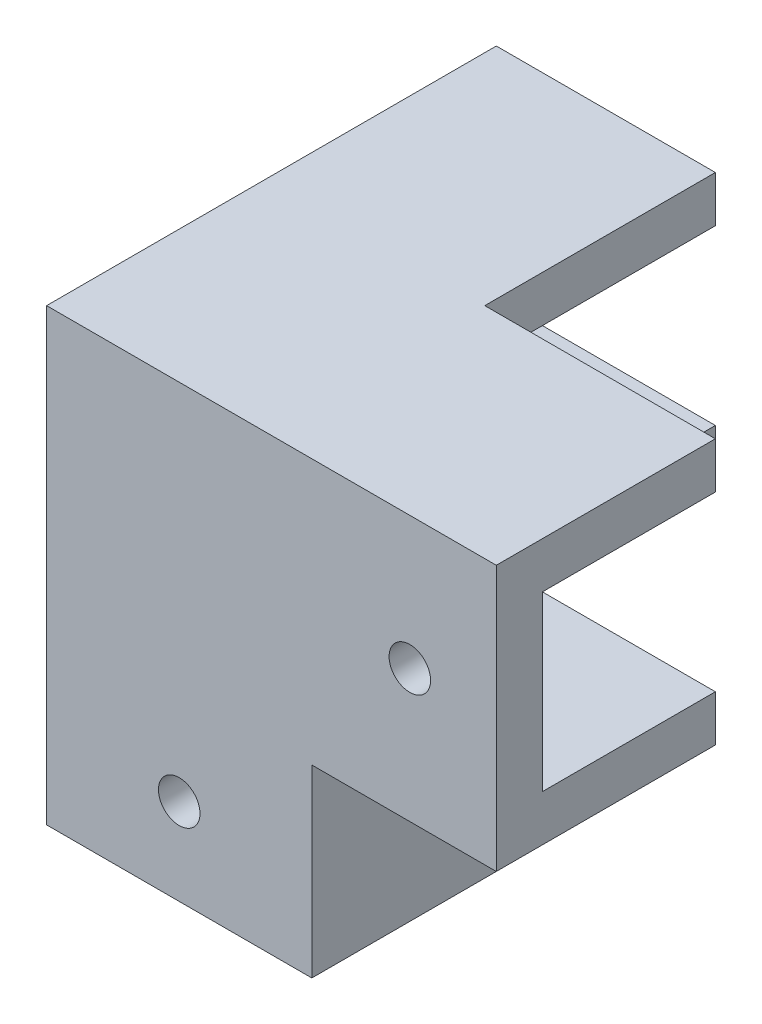
ISO-10303-21;
HEADER;
FILE_DESCRIPTION(('STEP AP214'),'2;1');
FILE_NAME('part.step','',(''),(''),'','','');
FILE_SCHEMA(('AUTOMOTIVE_DESIGN { 1 0 10303 214 1 1 1 1 }'));
ENDSEC;
DATA;
#1=APPLICATION_CONTEXT('core data for automotive mechanical design processes');
#2=APPLICATION_PROTOCOL_DEFINITION('international standard','automotive_design',2000,#1);
#3=PRODUCT_CONTEXT('',#1,'mechanical');
#4=PRODUCT('Part','Part','',(#3));
#5=PRODUCT_RELATED_PRODUCT_CATEGORY('part','',(#4));
#6=PRODUCT_DEFINITION_FORMATION('','',#4);
#7=PRODUCT_DEFINITION_CONTEXT('part definition',#1,'design');
#8=PRODUCT_DEFINITION('design','',#6,#7);
#9=PRODUCT_DEFINITION_SHAPE('','',#8);
#10=(LENGTH_UNIT() NAMED_UNIT(*) SI_UNIT(.MILLI.,.METRE.));
#11=(NAMED_UNIT(*) PLANE_ANGLE_UNIT() SI_UNIT($,.RADIAN.));
#12=(NAMED_UNIT(*) SI_UNIT($,.STERADIAN.) SOLID_ANGLE_UNIT());
#13=UNCERTAINTY_MEASURE_WITH_UNIT(LENGTH_MEASURE(1.E-05),#10,'distance_accuracy_value','');
#14=(GEOMETRIC_REPRESENTATION_CONTEXT(3) GLOBAL_UNCERTAINTY_ASSIGNED_CONTEXT((#13)) GLOBAL_UNIT_ASSIGNED_CONTEXT((#10,
#11,#12)) REPRESENTATION_CONTEXT('',''));
#15=CARTESIAN_POINT('',(0.,0.,0.));
#16=DIRECTION('',(0.,0.,1.));
#17=DIRECTION('',(1.,0.,0.));
#18=AXIS2_PLACEMENT_3D('',#15,#16,#17);
#19=CARTESIAN_POINT('',(0.,20.,-19.9096648090439));
#20=DIRECTION('',(0.,0.,-1.));
#21=DIRECTION('',(-1.,0.,0.));
#22=AXIS2_PLACEMENT_3D('',#19,#20,#21);
#23=PLANE('',#22);
#24=DIRECTION('',(0.,-1.,0.));
#25=VECTOR('',#24,1.);
#26=CARTESIAN_POINT('',(-10.0266666666667,20.,-19.9096648090439));
#27=LINE('',#26,#25);
#28=CARTESIAN_POINT('',(-10.0266666666667,16.,-19.9096648090439));
#29=VERTEX_POINT('',#28);
#30=CARTESIAN_POINT('',(-10.0266666666667,0.,-19.9096648090439));
#31=VERTEX_POINT('',#30);
#32=EDGE_CURVE('E64',#29,#31,#27,.T.);
#33=ORIENTED_EDGE('',*,*,#32,.F.);
#34=DIRECTION('',(-1.,0.,0.));
#35=VECTOR('',#34,1.);
#36=CARTESIAN_POINT('',(-10.0266666666667,16.,-19.9096648090439));
#37=LINE('',#36,#35);
#38=CARTESIAN_POINT('',(8.97333333333333,16.,-19.9096648090439));
#39=VERTEX_POINT('',#38);
#40=EDGE_CURVE('E59',#39,#29,#37,.T.);
#41=ORIENTED_EDGE('',*,*,#40,.F.);
#42=DIRECTION('',(0.,-1.,0.));
#43=VECTOR('',#42,1.);
#44=CARTESIAN_POINT('',(8.97333333333333,20.,-19.9096648090439));
#45=LINE('',#44,#43);
#46=CARTESIAN_POINT('',(8.97333333333333,0.,-19.9096648090439));
#47=VERTEX_POINT('',#46);
#48=EDGE_CURVE('E51',#39,#47,#45,.T.);
#49=ORIENTED_EDGE('',*,*,#48,.T.);
#50=DIRECTION('',(1.,0.,0.));
#51=VECTOR('',#50,1.);
#52=CARTESIAN_POINT('',(0.,0.,-19.9096648090439));
#53=LINE('',#52,#51);
#54=EDGE_CURVE('E363',#31,#47,#53,.T.);
#55=ORIENTED_EDGE('',*,*,#54,.F.);
#56=EDGE_LOOP('',(#33,#41,#49,#55));
#57=FACE_BOUND('',#56,.T.);
#58=ADVANCED_FACE('F41',(#57),#23,.T.);
#59=CARTESIAN_POINT('',(28.9733333333333,0.,-15.9096648090439));
#60=DIRECTION('',(0.,0.,-1.));
#61=DIRECTION('',(-1.,0.,0.));
#62=AXIS2_PLACEMENT_3D('',#59,#60,#61);
#63=PLANE('',#62);
#64=DIRECTION('',(-1.,0.,0.));
#65=VECTOR('',#64,1.);
#66=CARTESIAN_POINT('',(28.9733333333333,35.,-15.9096648090439));
#67=LINE('',#66,#65);
#68=CARTESIAN_POINT('',(28.9733333333333,35.,-15.9096648090439));
#69=VERTEX_POINT('',#68);
#70=CARTESIAN_POINT('',(8.97333333333332,35.,-15.9096648090439));
#71=VERTEX_POINT('',#70);
#72=EDGE_CURVE('E351',#69,#71,#67,.T.);
#73=ORIENTED_EDGE('',*,*,#72,.T.);
#74=DIRECTION('',(0.,1.,0.));
#75=VECTOR('',#74,1.);
#76=CARTESIAN_POINT('',(8.97333333333333,0.,-15.9096648090439));
#77=LINE('',#76,#75);
#78=CARTESIAN_POINT('',(8.97333333333332,39.,-15.9096648090439));
#79=VERTEX_POINT('',#78);
#80=EDGE_CURVE('E11',#71,#79,#77,.T.);
#81=ORIENTED_EDGE('',*,*,#80,.T.);
#82=DIRECTION('',(-1.,0.,0.));
#83=VECTOR('',#82,1.);
#84=CARTESIAN_POINT('',(28.9733333333333,39.,-15.9096648090439));
#85=LINE('',#84,#83);
#86=CARTESIAN_POINT('',(28.9733333333333,39.,-15.9096648090439));
#87=VERTEX_POINT('',#86);
#88=EDGE_CURVE('E336',#87,#79,#85,.T.);
#89=ORIENTED_EDGE('',*,*,#88,.F.);
#90=DIRECTION('',(0.,-1.,0.));
#91=VECTOR('',#90,1.);
#92=CARTESIAN_POINT('',(28.9733333333333,0.,-15.9096648090439));
#93=LINE('',#92,#91);
#94=EDGE_CURVE('E322',#87,#69,#93,.T.);
#95=ORIENTED_EDGE('',*,*,#94,.T.);
#96=EDGE_LOOP('',(#73,#81,#89,#95));
#97=FACE_BOUND('',#96,.T.);
#98=ADVANCED_FACE('F468',(#97),#63,.T.);
#99=CARTESIAN_POINT('',(12.9733333333333,0.,0.));
#100=DIRECTION('',(1.,0.,0.));
#101=DIRECTION('',(0.,0.,-1.));
#102=AXIS2_PLACEMENT_3D('',#99,#100,#101);
#103=PLANE('',#102);
#104=DIRECTION('',(0.,1.,0.));
#105=VECTOR('',#104,1.);
#106=CARTESIAN_POINT('',(12.9733333333333,20.,-15.8096648090439));
#107=LINE('',#106,#105);
#108=CARTESIAN_POINT('',(12.9733333333333,0.,-15.8096648090439));
#109=VERTEX_POINT('',#108);
#110=CARTESIAN_POINT('',(12.9733333333333,16.,-15.8096648090439));
#111=VERTEX_POINT('',#110);
#112=EDGE_CURVE('E297',#109,#111,#107,.T.);
#113=ORIENTED_EDGE('',*,*,#112,.T.);
#114=DIRECTION('',(0.,0.,-1.));
#115=VECTOR('',#114,1.);
#116=CARTESIAN_POINT('',(12.9733333333333,16.,3.09033519095607));
#117=LINE('',#116,#115);
#118=CARTESIAN_POINT('',(12.9733333333333,16.,3.09033519095607));
#119=VERTEX_POINT('',#118);
#120=EDGE_CURVE('E267',#119,#111,#117,.T.);
#121=ORIENTED_EDGE('',*,*,#120,.F.);
#122=DIRECTION('',(0.,-1.,0.));
#123=VECTOR('',#122,1.);
#124=CARTESIAN_POINT('',(12.9733333333333,20.,3.09033519095607));
#125=LINE('',#124,#123);
#126=CARTESIAN_POINT('',(12.9733333333333,0.,3.09033519095607));
#127=VERTEX_POINT('',#126);
#128=EDGE_CURVE('E289',#119,#127,#125,.T.);
#129=ORIENTED_EDGE('',*,*,#128,.T.);
#130=DIRECTION('',(0.,0.,-1.));
#131=VECTOR('',#130,1.);
#132=CARTESIAN_POINT('',(12.9733333333333,0.,3.09033519095607));
#133=LINE('',#132,#131);
#134=EDGE_CURVE('E292',#127,#109,#133,.T.);
#135=ORIENTED_EDGE('',*,*,#134,.T.);
#136=EDGE_LOOP('',(#113,#121,#129,#135));
#137=FACE_BOUND('',#136,.T.);
#138=ADVANCED_FACE('F472',(#137),#103,.T.);
#139=CARTESIAN_POINT('',(8.97333333333333,20.,0.));
#140=DIRECTION('',(1.,0.,0.));
#141=DIRECTION('',(0.,0.,-1.));
#142=AXIS2_PLACEMENT_3D('',#139,#140,#141);
#143=PLANE('',#142);
#144=DIRECTION('',(0.,0.,1.));
#145=VECTOR('',#144,1.);
#146=CARTESIAN_POINT('',(8.97333333333333,0.,0.));
#147=LINE('',#146,#145);
#148=CARTESIAN_POINT('',(8.97333333333333,0.,-15.9096648090439));
#149=VERTEX_POINT('',#148);
#150=EDGE_CURVE('E343',#47,#149,#147,.T.);
#151=ORIENTED_EDGE('',*,*,#150,.F.);
#152=ORIENTED_EDGE('',*,*,#48,.F.);
#153=DIRECTION('',(0.,0.,1.));
#154=VECTOR('',#153,1.);
#155=CARTESIAN_POINT('',(8.97333333333333,16.,-35.9096648090439));
#156=LINE('',#155,#154);
#157=CARTESIAN_POINT('',(8.97333333333333,16.,-35.9096648090439));
#158=VERTEX_POINT('',#157);
#159=EDGE_CURVE('E207',#158,#39,#156,.T.);
#160=ORIENTED_EDGE('',*,*,#159,.F.);
#161=DIRECTION('',(0.,-1.,0.));
#162=VECTOR('',#161,1.);
#163=CARTESIAN_POINT('',(8.97333333333333,20.,-35.9096648090439));
#164=LINE('',#163,#162);
#165=CARTESIAN_POINT('',(8.97333333333333,20.,-35.9096648090439));
#166=VERTEX_POINT('',#165);
#167=EDGE_CURVE('E198',#166,#158,#164,.T.);
#168=ORIENTED_EDGE('',*,*,#167,.F.);
#169=DIRECTION('',(0.,0.,1.));
#170=VECTOR('',#169,1.);
#171=CARTESIAN_POINT('',(8.97333333333333,20.,0.));
#172=LINE('',#171,#170);
#173=CARTESIAN_POINT('',(8.97333333333333,20.,-15.9096648090439));
#174=VERTEX_POINT('',#173);
#175=EDGE_CURVE('E181',#166,#174,#172,.T.);
#176=ORIENTED_EDGE('',*,*,#175,.T.);
#177=DIRECTION('',(0.,-1.,0.));
#178=VECTOR('',#177,1.);
#179=CARTESIAN_POINT('',(8.97333333333333,20.,-15.9096648090439));
#180=LINE('',#179,#178);
#181=EDGE_CURVE('E359',#174,#149,#180,.T.);
#182=ORIENTED_EDGE('',*,*,#181,.T.);
#183=EDGE_LOOP('',(#151,#152,#160,#168,#176,#182));
#184=FACE_BOUND('',#183,.T.);
#185=ADVANCED_FACE('F43',(#184),#143,.T.);
#186=CARTESIAN_POINT('',(-10.0266666666667,20.,0.));
#187=DIRECTION('',(-1.,0.,0.));
#188=DIRECTION('',(0.,0.,1.));
#189=AXIS2_PLACEMENT_3D('',#186,#187,#188);
#190=PLANE('',#189);
#191=CARTESIAN_POINT('',(-10.0266666666667,27.5,-28.4096648090439));
#192=DIRECTION('',(-1.,0.,0.));
#193=DIRECTION('',(0.,0.,1.));
#194=AXIS2_PLACEMENT_3D('',#191,#192,#193);
#195=CIRCLE('',#194,1.8);
#196=CARTESIAN_POINT('',(-10.0266666666667,27.5,-26.6096648090439));
#197=VERTEX_POINT('',#196);
#198=EDGE_CURVE('E413',#197,#197,#195,.T.);
#199=ORIENTED_EDGE('',*,*,#198,.F.);
#200=EDGE_LOOP('',(#199));
#201=FACE_BOUND('',#200,.T.);
#202=CARTESIAN_POINT('',(-10.0266666666667,7.5,-8.40966480904393));
#203=DIRECTION('',(-1.,0.,0.));
#204=DIRECTION('',(0.,0.,1.));
#205=AXIS2_PLACEMENT_3D('',#202,#203,#204);
#206=CIRCLE('',#205,1.8);
#207=CARTESIAN_POINT('',(-10.0266666666667,7.5,-6.60966480904393));
#208=VERTEX_POINT('',#207);
#209=EDGE_CURVE('E423',#208,#208,#206,.T.);
#210=ORIENTED_EDGE('',*,*,#209,.F.);
#211=EDGE_LOOP('',(#210));
#212=FACE_BOUND('',#211,.T.);
#213=DIRECTION('',(0.,0.,1.));
#214=VECTOR('',#213,1.);
#215=CARTESIAN_POINT('',(-10.0266666666667,16.,-35.9096648090439));
#216=LINE('',#215,#214);
#217=CARTESIAN_POINT('',(-10.0266666666667,16.,-35.9096648090439));
#218=VERTEX_POINT('',#217);
#219=EDGE_CURVE('E213',#218,#29,#216,.T.);
#220=ORIENTED_EDGE('',*,*,#219,.T.);
#221=ORIENTED_EDGE('',*,*,#32,.T.);
#222=DIRECTION('',(0.,0.,-1.));
#223=VECTOR('',#222,1.);
#224=CARTESIAN_POINT('',(-10.0266666666667,0.,0.));
#225=LINE('',#224,#223);
#226=CARTESIAN_POINT('',(-10.0266666666667,0.,3.09033519095607));
#227=VERTEX_POINT('',#226);
#228=EDGE_CURVE('E367',#227,#31,#225,.T.);
#229=ORIENTED_EDGE('',*,*,#228,.F.);
#230=DIRECTION('',(0.,-1.,0.));
#231=VECTOR('',#230,1.);
#232=CARTESIAN_POINT('',(-10.0266666666667,20.,3.09033519095607));
#233=LINE('',#232,#231);
#234=CARTESIAN_POINT('',(-10.0266666666667,39.,3.09033519095607));
#235=VERTEX_POINT('',#234);
#236=EDGE_CURVE('E398',#235,#227,#233,.T.);
#237=ORIENTED_EDGE('',*,*,#236,.F.);
#238=DIRECTION('',(0.,0.,-1.));
#239=VECTOR('',#238,1.);
#240=CARTESIAN_POINT('',(-10.0266666666667,39.,0.));
#241=LINE('',#240,#239);
#242=CARTESIAN_POINT('',(-10.0266666666667,39.,-35.9096648090439));
#243=VERTEX_POINT('',#242);
#244=EDGE_CURVE('E317',#235,#243,#241,.T.);
#245=ORIENTED_EDGE('',*,*,#244,.T.);
#246=DIRECTION('',(0.,1.,0.));
#247=VECTOR('',#246,1.);
#248=CARTESIAN_POINT('',(-10.0266666666667,0.,-35.9096648090439));
#249=LINE('',#248,#247);
#250=EDGE_CURVE('E234',#218,#243,#249,.T.);
#251=ORIENTED_EDGE('',*,*,#250,.F.);
#252=EDGE_LOOP('',(#220,#221,#229,#237,#245,#251));
#253=FACE_BOUND('',#252,.T.);
#254=ADVANCED_FACE('F476',(#201,#212,#253),#190,.T.);
#255=CARTESIAN_POINT('',(0.,20.,3.09033519095607));
#256=DIRECTION('',(0.,0.,-1.));
#257=DIRECTION('',(-1.,0.,0.));
#258=AXIS2_PLACEMENT_3D('',#255,#256,#257);
#259=PLANE('',#258);
#260=CARTESIAN_POINT('',(1.47333333333333,7.5,3.09033519095607));
#261=DIRECTION('',(0.,0.,1.));
#262=DIRECTION('',(1.,0.,0.));
#263=AXIS2_PLACEMENT_3D('',#260,#261,#262);
#264=CIRCLE('',#263,1.8);
#265=CARTESIAN_POINT('',(3.27333333333333,7.5,3.09033519095607));
#266=VERTEX_POINT('',#265);
#267=EDGE_CURVE('E430',#266,#266,#264,.T.);
#268=ORIENTED_EDGE('',*,*,#267,.F.);
#269=EDGE_LOOP('',(#268));
#270=FACE_BOUND('',#269,.T.);
#271=CARTESIAN_POINT('',(21.4733333333333,27.5,3.09033519095607));
#272=DIRECTION('',(0.,0.,1.));
#273=DIRECTION('',(1.,0.,0.));
#274=AXIS2_PLACEMENT_3D('',#271,#272,#273);
#275=CIRCLE('',#274,1.8);
#276=CARTESIAN_POINT('',(23.2733333333333,27.5,3.09033519095607));
#277=VERTEX_POINT('',#276);
#278=EDGE_CURVE('E408',#277,#277,#275,.T.);
#279=ORIENTED_EDGE('',*,*,#278,.F.);
#280=EDGE_LOOP('',(#279));
#281=FACE_BOUND('',#280,.T.);
#282=DIRECTION('',(1.,0.,0.));
#283=VECTOR('',#282,1.);
#284=CARTESIAN_POINT('',(0.,0.,3.09033519095607));
#285=LINE('',#284,#283);
#286=EDGE_CURVE('E371',#227,#127,#285,.T.);
#287=ORIENTED_EDGE('',*,*,#286,.T.);
#288=ORIENTED_EDGE('',*,*,#128,.F.);
#289=DIRECTION('',(-1.,0.,0.));
#290=VECTOR('',#289,1.);
#291=CARTESIAN_POINT('',(28.9733333333333,16.,3.09033519095607));
#292=LINE('',#291,#290);
#293=CARTESIAN_POINT('',(28.9733333333333,16.,3.09033519095607));
#294=VERTEX_POINT('',#293);
#295=EDGE_CURVE('E284',#294,#119,#292,.T.);
#296=ORIENTED_EDGE('',*,*,#295,.F.);
#297=DIRECTION('',(0.,1.,0.));
#298=VECTOR('',#297,1.);
#299=CARTESIAN_POINT('',(28.9733333333333,0.,3.09033519095607));
#300=LINE('',#299,#298);
#301=CARTESIAN_POINT('',(28.9733333333333,39.,3.09033519095607));
#302=VERTEX_POINT('',#301);
#303=EDGE_CURVE('E332',#294,#302,#300,.T.);
#304=ORIENTED_EDGE('',*,*,#303,.T.);
#305=DIRECTION('',(-1.,0.,0.));
#306=VECTOR('',#305,1.);
#307=CARTESIAN_POINT('',(28.9733333333333,39.,3.09033519095607));
#308=LINE('',#307,#306);
#309=EDGE_CURVE('E339',#302,#235,#308,.T.);
#310=ORIENTED_EDGE('',*,*,#309,.T.);
#311=ORIENTED_EDGE('',*,*,#236,.T.);
#312=EDGE_LOOP('',(#287,#288,#296,#304,#310,#311));
#313=FACE_BOUND('',#312,.T.);
#314=ADVANCED_FACE('F445',(#270,#281,#313),#259,.F.);
#315=CARTESIAN_POINT('',(0.,20.,-0.909664809043927));
#316=DIRECTION('',(0.,0.,-1.));
#317=DIRECTION('',(-1.,0.,0.));
#318=AXIS2_PLACEMENT_3D('',#315,#316,#317);
#319=PLANE('',#318);
#320=CARTESIAN_POINT('',(1.47333333333333,7.5,-0.909664809043927));
#321=DIRECTION('',(0.,0.,-1.));
#322=DIRECTION('',(-1.,0.,0.));
#323=AXIS2_PLACEMENT_3D('',#320,#321,#322);
#324=CIRCLE('',#323,1.8);
#325=CARTESIAN_POINT('',(-0.326666666666673,7.5,-0.909664809043927));
#326=VERTEX_POINT('',#325);
#327=EDGE_CURVE('E45',#326,#326,#324,.T.);
#328=ORIENTED_EDGE('',*,*,#327,.F.);
#329=EDGE_LOOP('',(#328));
#330=FACE_BOUND('',#329,.T.);
#331=CARTESIAN_POINT('',(21.4733333333333,27.5,-0.909664809043927));
#332=DIRECTION('',(0.,0.,-1.));
#333=DIRECTION('',(-1.,0.,0.));
#334=AXIS2_PLACEMENT_3D('',#331,#332,#333);
#335=CIRCLE('',#334,1.8);
#336=CARTESIAN_POINT('',(19.6733333333333,27.5,-0.909664809043927));
#337=VERTEX_POINT('',#336);
#338=EDGE_CURVE('E219',#337,#337,#335,.T.);
#339=ORIENTED_EDGE('',*,*,#338,.F.);
#340=EDGE_LOOP('',(#339));
#341=FACE_BOUND('',#340,.T.);
#342=DIRECTION('',(0.,-1.,0.));
#343=VECTOR('',#342,1.);
#344=CARTESIAN_POINT('',(-6.02666666666667,20.,-0.909664809043927));
#345=LINE('',#344,#343);
#346=CARTESIAN_POINT('',(-6.02666666666668,35.,-0.909664809043926));
#347=VERTEX_POINT('',#346);
#348=CARTESIAN_POINT('',(-6.02666666666667,0.,-0.909664809043927));
#349=VERTEX_POINT('',#348);
#350=EDGE_CURVE('E391',#347,#349,#345,.T.);
#351=ORIENTED_EDGE('',*,*,#350,.F.);
#352=DIRECTION('',(-1.,0.,0.));
#353=VECTOR('',#352,1.);
#354=CARTESIAN_POINT('',(28.9733333333333,35.,-0.909664809043926));
#355=LINE('',#354,#353);
#356=CARTESIAN_POINT('',(28.9733333333333,35.,-0.909664809043926));
#357=VERTEX_POINT('',#356);
#358=EDGE_CURVE('E347',#357,#347,#355,.T.);
#359=ORIENTED_EDGE('',*,*,#358,.F.);
#360=DIRECTION('',(0.,1.,0.));
#361=VECTOR('',#360,1.);
#362=CARTESIAN_POINT('',(28.9733333333333,0.,-0.909664809043922));
#363=LINE('',#362,#361);
#364=CARTESIAN_POINT('',(28.9733333333333,20.,-0.909664809043924));
#365=VERTEX_POINT('',#364);
#366=EDGE_CURVE('E329',#365,#357,#363,.T.);
#367=ORIENTED_EDGE('',*,*,#366,.F.);
#368=DIRECTION('',(-1.,0.,0.));
#369=VECTOR('',#368,1.);
#370=CARTESIAN_POINT('',(28.9733333333333,20.,-0.909664809043924));
#371=LINE('',#370,#369);
#372=CARTESIAN_POINT('',(8.97333333333333,20.,-0.909664809043924));
#373=VERTEX_POINT('',#372);
#374=EDGE_CURVE('E344',#365,#373,#371,.T.);
#375=ORIENTED_EDGE('',*,*,#374,.T.);
#376=DIRECTION('',(0.,-1.,0.));
#377=VECTOR('',#376,1.);
#378=CARTESIAN_POINT('',(8.97333333333333,20.,-0.909664809043927));
#379=LINE('',#378,#377);
#380=CARTESIAN_POINT('',(8.97333333333333,0.,-0.909664809043927));
#381=VERTEX_POINT('',#380);
#382=EDGE_CURVE('E394',#373,#381,#379,.T.);
#383=ORIENTED_EDGE('',*,*,#382,.T.);
#384=DIRECTION('',(1.,0.,0.));
#385=VECTOR('',#384,1.);
#386=CARTESIAN_POINT('',(0.,0.,-0.909664809043927));
#387=LINE('',#386,#385);
#388=EDGE_CURVE('E375',#349,#381,#387,.T.);
#389=ORIENTED_EDGE('',*,*,#388,.F.);
#390=EDGE_LOOP('',(#351,#359,#367,#375,#383,#389));
#391=FACE_BOUND('',#390,.T.);
#392=ADVANCED_FACE('F441',(#330,#341,#391),#319,.T.);
#393=CARTESIAN_POINT('',(-6.02666666666667,20.,0.));
#394=DIRECTION('',(-1.,0.,0.));
#395=DIRECTION('',(0.,0.,1.));
#396=AXIS2_PLACEMENT_3D('',#393,#394,#395);
#397=PLANE('',#396);
#398=CARTESIAN_POINT('',(-6.02666666666667,27.5,-28.4096648090439));
#399=DIRECTION('',(-1.,0.,0.));
#400=DIRECTION('',(0.,0.,1.));
#401=AXIS2_PLACEMENT_3D('',#398,#399,#400);
#402=CIRCLE('',#401,1.8);
#403=CARTESIAN_POINT('',(-6.02666666666667,27.5,-26.6096648090439));
#404=VERTEX_POINT('',#403);
#405=EDGE_CURVE('E412',#404,#404,#402,.T.);
#406=ORIENTED_EDGE('',*,*,#405,.T.);
#407=EDGE_LOOP('',(#406));
#408=FACE_BOUND('',#407,.T.);
#409=CARTESIAN_POINT('',(-6.02666666666667,7.5,-8.40966480904393));
#410=DIRECTION('',(-1.,0.,0.));
#411=DIRECTION('',(0.,0.,1.));
#412=AXIS2_PLACEMENT_3D('',#409,#410,#411);
#413=CIRCLE('',#412,1.8);
#414=CARTESIAN_POINT('',(-6.02666666666667,7.5,-6.60966480904393));
#415=VERTEX_POINT('',#414);
#416=EDGE_CURVE('E409',#415,#415,#413,.T.);
#417=ORIENTED_EDGE('',*,*,#416,.T.);
#418=EDGE_LOOP('',(#417));
#419=FACE_BOUND('',#418,.T.);
#420=DIRECTION('',(0.,0.,-1.));
#421=VECTOR('',#420,1.);
#422=CARTESIAN_POINT('',(-6.02666666666667,0.,0.));
#423=LINE('',#422,#421);
#424=CARTESIAN_POINT('',(-6.02666666666667,0.,-15.9096648090439));
#425=VERTEX_POINT('',#424);
#426=EDGE_CURVE('E379',#349,#425,#423,.T.);
#427=ORIENTED_EDGE('',*,*,#426,.T.);
#428=DIRECTION('',(0.,-1.,0.));
#429=VECTOR('',#428,1.);
#430=CARTESIAN_POINT('',(-6.02666666666667,20.,-15.9096648090439));
#431=LINE('',#430,#429);
#432=CARTESIAN_POINT('',(-6.02666666666667,20.,-15.9096648090439));
#433=VERTEX_POINT('',#432);
#434=EDGE_CURVE('E387',#433,#425,#431,.T.);
#435=ORIENTED_EDGE('',*,*,#434,.F.);
#436=DIRECTION('',(0.,0.,-1.));
#437=VECTOR('',#436,1.);
#438=CARTESIAN_POINT('',(-6.02666666666668,20.,-0.909664809043927));
#439=LINE('',#438,#437);
#440=CARTESIAN_POINT('',(-6.02666666666667,20.,-35.9096648090439));
#441=VERTEX_POINT('',#440);
#442=EDGE_CURVE('E247',#433,#441,#439,.T.);
#443=ORIENTED_EDGE('',*,*,#442,.T.);
#444=DIRECTION('',(0.,-1.,0.));
#445=VECTOR('',#444,1.);
#446=CARTESIAN_POINT('',(-6.02666666666668,0.,-35.9096648090439));
#447=LINE('',#446,#445);
#448=CARTESIAN_POINT('',(-6.02666666666667,35.,-35.9096648090439));
#449=VERTEX_POINT('',#448);
#450=EDGE_CURVE('E202',#449,#441,#447,.T.);
#451=ORIENTED_EDGE('',*,*,#450,.F.);
#452=DIRECTION('',(0.,0.,-1.));
#453=VECTOR('',#452,1.);
#454=CARTESIAN_POINT('',(-6.02666666666667,35.,-0.909664809043927));
#455=LINE('',#454,#453);
#456=EDGE_CURVE('E250',#347,#449,#455,.T.);
#457=ORIENTED_EDGE('',*,*,#456,.F.);
#458=ORIENTED_EDGE('',*,*,#350,.T.);
#459=EDGE_LOOP('',(#427,#435,#443,#451,#457,#458));
#460=FACE_BOUND('',#459,.T.);
#461=ADVANCED_FACE('F444',(#408,#419,#460),#397,.F.);
#462=CARTESIAN_POINT('',(0.,20.,-15.9096648090439));
#463=DIRECTION('',(0.,0.,-1.));
#464=DIRECTION('',(-1.,0.,0.));
#465=AXIS2_PLACEMENT_3D('',#462,#463,#464);
#466=PLANE('',#465);
#467=DIRECTION('',(1.,0.,0.));
#468=VECTOR('',#467,1.);
#469=CARTESIAN_POINT('',(0.,0.,-15.9096648090439));
#470=LINE('',#469,#468);
#471=EDGE_CURVE('E191',#425,#149,#470,.T.);
#472=ORIENTED_EDGE('',*,*,#471,.T.);
#473=ORIENTED_EDGE('',*,*,#181,.F.);
#474=DIRECTION('',(1.,0.,0.));
#475=VECTOR('',#474,1.);
#476=CARTESIAN_POINT('',(0.,20.,-15.9096648090439));
#477=LINE('',#476,#475);
#478=EDGE_CURVE('E186',#433,#174,#477,.T.);
#479=ORIENTED_EDGE('',*,*,#478,.F.);
#480=ORIENTED_EDGE('',*,*,#434,.T.);
#481=EDGE_LOOP('',(#472,#473,#479,#480));
#482=FACE_BOUND('',#481,.T.);
#483=ADVANCED_FACE('F462',(#482),#466,.F.);
#484=CARTESIAN_POINT('',(0.,20.,0.));
#485=DIRECTION('',(0.,1.,0.));
#486=DIRECTION('',(0.,0.,1.));
#487=AXIS2_PLACEMENT_3D('',#484,#485,#486);
#488=PLANE('',#487);
#489=ORIENTED_EDGE('',*,*,#442,.F.);
#490=ORIENTED_EDGE('',*,*,#478,.T.);
#491=ORIENTED_EDGE('',*,*,#175,.F.);
#492=DIRECTION('',(1.,0.,0.));
#493=VECTOR('',#492,1.);
#494=CARTESIAN_POINT('',(-10.0266666666667,20.,-35.9096648090439));
#495=LINE('',#494,#493);
#496=EDGE_CURVE('E184',#441,#166,#495,.T.);
#497=ORIENTED_EDGE('',*,*,#496,.F.);
#498=EDGE_LOOP('',(#489,#490,#491,#497));
#499=FACE_BOUND('',#498,.T.);
#500=ADVANCED_FACE('F183',(#499),#488,.T.);
#501=CARTESIAN_POINT('',(0.,0.,0.));
#502=DIRECTION('',(0.,1.,0.));
#503=DIRECTION('',(0.,0.,1.));
#504=AXIS2_PLACEMENT_3D('',#501,#502,#503);
#505=PLANE('',#504);
#506=ORIENTED_EDGE('',*,*,#150,.T.);
#507=ORIENTED_EDGE('',*,*,#471,.F.);
#508=ORIENTED_EDGE('',*,*,#426,.F.);
#509=ORIENTED_EDGE('',*,*,#388,.T.);
#510=DIRECTION('',(0.,0.,-1.));
#511=VECTOR('',#510,1.);
#512=CARTESIAN_POINT('',(8.97333333333333,0.,3.09033519095607));
#513=LINE('',#512,#511);
#514=CARTESIAN_POINT('',(8.97333333333333,0.,-15.8096648090439));
#515=VERTEX_POINT('',#514);
#516=EDGE_CURVE('E288',#381,#515,#513,.T.);
#517=ORIENTED_EDGE('',*,*,#516,.T.);
#518=DIRECTION('',(-1.,0.,0.));
#519=VECTOR('',#518,1.);
#520=CARTESIAN_POINT('',(12.9733333333333,0.,-15.8096648090439));
#521=LINE('',#520,#519);
#522=EDGE_CURVE('E313',#109,#515,#521,.T.);
#523=ORIENTED_EDGE('',*,*,#522,.F.);
#524=ORIENTED_EDGE('',*,*,#134,.F.);
#525=ORIENTED_EDGE('',*,*,#286,.F.);
#526=ORIENTED_EDGE('',*,*,#228,.T.);
#527=ORIENTED_EDGE('',*,*,#54,.T.);
#528=EDGE_LOOP('',(#506,#507,#508,#509,#517,#523,#524,#525,#526,#527));
#529=FACE_BOUND('',#528,.T.);
#530=ADVANCED_FACE('F464',(#529),#505,.F.);
#531=CARTESIAN_POINT('',(28.9733333333333,39.,0.));
#532=DIRECTION('',(0.,1.,0.));
#533=DIRECTION('',(0.,0.,1.));
#534=AXIS2_PLACEMENT_3D('',#531,#532,#533);
#535=PLANE('',#534);
#536=ORIENTED_EDGE('',*,*,#88,.T.);
#537=DIRECTION('',(0.,0.,-1.));
#538=VECTOR('',#537,1.);
#539=CARTESIAN_POINT('',(8.97333333333333,39.,-0.909664809043927));
#540=LINE('',#539,#538);
#541=CARTESIAN_POINT('',(8.97333333333333,39.,-35.9096648090439));
#542=VERTEX_POINT('',#541);
#543=EDGE_CURVE('E243',#79,#542,#540,.T.);
#544=ORIENTED_EDGE('',*,*,#543,.T.);
#545=DIRECTION('',(1.,0.,0.));
#546=VECTOR('',#545,1.);
#547=CARTESIAN_POINT('',(0.,39.,-35.9096648090439));
#548=LINE('',#547,#546);
#549=EDGE_CURVE('E238',#243,#542,#548,.T.);
#550=ORIENTED_EDGE('',*,*,#549,.F.);
#551=ORIENTED_EDGE('',*,*,#244,.F.);
#552=ORIENTED_EDGE('',*,*,#309,.F.);
#553=DIRECTION('',(0.,0.,-1.));
#554=VECTOR('',#553,1.);
#555=CARTESIAN_POINT('',(28.9733333333333,39.,0.));
#556=LINE('',#555,#554);
#557=EDGE_CURVE('E318',#302,#87,#556,.T.);
#558=ORIENTED_EDGE('',*,*,#557,.T.);
#559=EDGE_LOOP('',(#536,#544,#550,#551,#552,#558));
#560=FACE_BOUND('',#559,.T.);
#561=ADVANCED_FACE('F489',(#560),#535,.T.);
#562=CARTESIAN_POINT('',(28.9733333333333,35.,0.));
#563=DIRECTION('',(0.,1.,0.));
#564=DIRECTION('',(0.,0.,1.));
#565=AXIS2_PLACEMENT_3D('',#562,#563,#564);
#566=PLANE('',#565);
#567=ORIENTED_EDGE('',*,*,#456,.T.);
#568=DIRECTION('',(-1.,0.,0.));
#569=VECTOR('',#568,1.);
#570=CARTESIAN_POINT('',(0.,35.,-35.9096648090439));
#571=LINE('',#570,#569);
#572=CARTESIAN_POINT('',(8.97333333333333,35.,-35.9096648090439));
#573=VERTEX_POINT('',#572);
#574=EDGE_CURVE('E229',#573,#449,#571,.T.);
#575=ORIENTED_EDGE('',*,*,#574,.F.);
#576=DIRECTION('',(0.,0.,-1.));
#577=VECTOR('',#576,1.);
#578=CARTESIAN_POINT('',(8.97333333333333,35.,-0.909664809043927));
#579=LINE('',#578,#577);
#580=EDGE_CURVE('E242',#71,#573,#579,.T.);
#581=ORIENTED_EDGE('',*,*,#580,.F.);
#582=ORIENTED_EDGE('',*,*,#72,.F.);
#583=DIRECTION('',(0.,0.,-1.));
#584=VECTOR('',#583,1.);
#585=CARTESIAN_POINT('',(28.9733333333333,35.,0.));
#586=LINE('',#585,#584);
#587=EDGE_CURVE('E326',#357,#69,#586,.T.);
#588=ORIENTED_EDGE('',*,*,#587,.F.);
#589=ORIENTED_EDGE('',*,*,#358,.T.);
#590=EDGE_LOOP('',(#567,#575,#581,#582,#588,#589));
#591=FACE_BOUND('',#590,.T.);
#592=ADVANCED_FACE('F456',(#591),#566,.F.);
#593=CARTESIAN_POINT('',(28.9733333333333,0.,0.));
#594=DIRECTION('',(-1.,0.,0.));
#595=DIRECTION('',(0.,0.,1.));
#596=AXIS2_PLACEMENT_3D('',#593,#594,#595);
#597=PLANE('',#596);
#598=ORIENTED_EDGE('',*,*,#557,.F.);
#599=ORIENTED_EDGE('',*,*,#303,.F.);
#600=DIRECTION('',(0.,0.,-1.));
#601=VECTOR('',#600,1.);
#602=CARTESIAN_POINT('',(28.9733333333333,16.,3.09033519095607));
#603=LINE('',#602,#601);
#604=CARTESIAN_POINT('',(28.9733333333333,16.,-15.9096648090439));
#605=VERTEX_POINT('',#604);
#606=EDGE_CURVE('E255',#294,#605,#603,.T.);
#607=ORIENTED_EDGE('',*,*,#606,.T.);
#608=DIRECTION('',(0.,1.,0.));
#609=VECTOR('',#608,1.);
#610=CARTESIAN_POINT('',(28.9733333333333,20.,-15.9096648090439));
#611=LINE('',#610,#609);
#612=CARTESIAN_POINT('',(28.9733333333333,20.,-15.9096648090439));
#613=VERTEX_POINT('',#612);
#614=EDGE_CURVE('E258',#605,#613,#611,.T.);
#615=ORIENTED_EDGE('',*,*,#614,.T.);
#616=DIRECTION('',(0.,0.,1.));
#617=VECTOR('',#616,1.);
#618=CARTESIAN_POINT('',(28.9733333333333,20.,3.09033519095607));
#619=LINE('',#618,#617);
#620=EDGE_CURVE('E262',#613,#365,#619,.T.);
#621=ORIENTED_EDGE('',*,*,#620,.T.);
#622=ORIENTED_EDGE('',*,*,#366,.T.);
#623=ORIENTED_EDGE('',*,*,#587,.T.);
#624=ORIENTED_EDGE('',*,*,#94,.F.);
#625=EDGE_LOOP('',(#598,#599,#607,#615,#621,#622,#623,#624));
#626=FACE_BOUND('',#625,.T.);
#627=ADVANCED_FACE('F497',(#626),#597,.F.);
#628=CARTESIAN_POINT('',(12.9733333333333,20.,-15.8096648090439));
#629=DIRECTION('',(0.,0.,1.));
#630=DIRECTION('',(1.,0.,0.));
#631=AXIS2_PLACEMENT_3D('',#628,#629,#630);
#632=PLANE('',#631);
#633=DIRECTION('',(0.,1.,0.));
#634=VECTOR('',#633,1.);
#635=CARTESIAN_POINT('',(8.97333333333333,20.,-15.8096648090439));
#636=LINE('',#635,#634);
#637=CARTESIAN_POINT('',(8.97333333333333,20.,-15.8096648090439));
#638=VERTEX_POINT('',#637);
#639=EDGE_CURVE('E304',#515,#638,#636,.T.);
#640=ORIENTED_EDGE('',*,*,#639,.T.);
#641=DIRECTION('',(-1.,0.,0.));
#642=VECTOR('',#641,1.);
#643=CARTESIAN_POINT('',(12.9733333333333,20.,-15.8096648090439));
#644=LINE('',#643,#642);
#645=CARTESIAN_POINT('',(12.9733333333333,20.,-15.8096648090439));
#646=VERTEX_POINT('',#645);
#647=EDGE_CURVE('E301',#646,#638,#644,.T.);
#648=ORIENTED_EDGE('',*,*,#647,.F.);
#649=EDGE_CURVE('E296',#111,#646,#107,.T.);
#650=ORIENTED_EDGE('',*,*,#649,.F.);
#651=ORIENTED_EDGE('',*,*,#112,.F.);
#652=ORIENTED_EDGE('',*,*,#522,.T.);
#653=EDGE_LOOP('',(#640,#648,#650,#651,#652));
#654=FACE_BOUND('',#653,.T.);
#655=ADVANCED_FACE('F500',(#654),#632,.F.);
#656=CARTESIAN_POINT('',(12.9733333333333,20.,3.09033519095607));
#657=DIRECTION('',(0.,-1.,0.));
#658=DIRECTION('',(0.,0.,-1.));
#659=AXIS2_PLACEMENT_3D('',#656,#657,#658);
#660=PLANE('',#659);
#661=DIRECTION('',(0.,0.,1.));
#662=VECTOR('',#661,1.);
#663=CARTESIAN_POINT('',(8.97333333333333,20.,3.09033519095607));
#664=LINE('',#663,#662);
#665=EDGE_CURVE('E293',#638,#373,#664,.T.);
#666=ORIENTED_EDGE('',*,*,#665,.T.);
#667=ORIENTED_EDGE('',*,*,#374,.F.);
#668=ORIENTED_EDGE('',*,*,#620,.F.);
#669=DIRECTION('',(-1.,0.,0.));
#670=VECTOR('',#669,1.);
#671=CARTESIAN_POINT('',(28.9733333333333,20.,-15.9096648090439));
#672=LINE('',#671,#670);
#673=CARTESIAN_POINT('',(12.9733333333333,20.,-15.9096648090439));
#674=VERTEX_POINT('',#673);
#675=EDGE_CURVE('E266',#613,#674,#672,.T.);
#676=ORIENTED_EDGE('',*,*,#675,.T.);
#677=DIRECTION('',(0.,0.,1.));
#678=VECTOR('',#677,1.);
#679=CARTESIAN_POINT('',(12.9733333333333,20.,3.09033519095607));
#680=LINE('',#679,#678);
#681=EDGE_CURVE('E259',#674,#646,#680,.T.);
#682=ORIENTED_EDGE('',*,*,#681,.T.);
#683=ORIENTED_EDGE('',*,*,#647,.T.);
#684=EDGE_LOOP('',(#666,#667,#668,#676,#682,#683));
#685=FACE_BOUND('',#684,.T.);
#686=ADVANCED_FACE('F504',(#685),#660,.F.);
#687=CARTESIAN_POINT('',(8.97333333333333,0.,0.));
#688=DIRECTION('',(1.,0.,0.));
#689=DIRECTION('',(0.,0.,-1.));
#690=AXIS2_PLACEMENT_3D('',#687,#688,#689);
#691=PLANE('',#690);
#692=ORIENTED_EDGE('',*,*,#382,.F.);
#693=ORIENTED_EDGE('',*,*,#665,.F.);
#694=ORIENTED_EDGE('',*,*,#639,.F.);
#695=ORIENTED_EDGE('',*,*,#516,.F.);
#696=EDGE_LOOP('',(#692,#693,#694,#695));
#697=FACE_BOUND('',#696,.T.);
#698=ADVANCED_FACE('F508',(#697),#691,.F.);
#699=CARTESIAN_POINT('',(12.9733333333333,0.,0.));
#700=DIRECTION('',(1.,0.,0.));
#701=DIRECTION('',(0.,0.,-1.));
#702=AXIS2_PLACEMENT_3D('',#699,#700,#701);
#703=PLANE('',#702);
#704=CARTESIAN_POINT('',(12.9733333333333,16.,-15.9096648090439));
#705=VERTEX_POINT('',#704);
#706=EDGE_CURVE('E246',#111,#705,#117,.T.);
#707=ORIENTED_EDGE('',*,*,#706,.F.);
#708=ORIENTED_EDGE('',*,*,#649,.T.);
#709=ORIENTED_EDGE('',*,*,#681,.F.);
#710=DIRECTION('',(0.,1.,0.));
#711=VECTOR('',#710,1.);
#712=CARTESIAN_POINT('',(12.9733333333333,20.,-15.9096648090439));
#713=LINE('',#712,#711);
#714=EDGE_CURVE('E271',#705,#674,#713,.T.);
#715=ORIENTED_EDGE('',*,*,#714,.F.);
#716=EDGE_LOOP('',(#707,#708,#709,#715));
#717=FACE_BOUND('',#716,.T.);
#718=ADVANCED_FACE('F512',(#717),#703,.F.);
#719=CARTESIAN_POINT('',(28.9733333333333,16.,3.09033519095607));
#720=DIRECTION('',(0.,1.,0.));
#721=DIRECTION('',(0.,0.,1.));
#722=AXIS2_PLACEMENT_3D('',#719,#720,#721);
#723=PLANE('',#722);
#724=ORIENTED_EDGE('',*,*,#120,.T.);
#725=ORIENTED_EDGE('',*,*,#706,.T.);
#726=DIRECTION('',(-1.,0.,0.));
#727=VECTOR('',#726,1.);
#728=CARTESIAN_POINT('',(28.9733333333333,16.,-15.9096648090439));
#729=LINE('',#728,#727);
#730=EDGE_CURVE('E280',#605,#705,#729,.T.);
#731=ORIENTED_EDGE('',*,*,#730,.F.);
#732=ORIENTED_EDGE('',*,*,#606,.F.);
#733=ORIENTED_EDGE('',*,*,#295,.T.);
#734=EDGE_LOOP('',(#724,#725,#731,#732,#733));
#735=FACE_BOUND('',#734,.T.);
#736=ADVANCED_FACE('F517',(#735),#723,.F.);
#737=CARTESIAN_POINT('',(28.9733333333333,20.,-15.9096648090439));
#738=DIRECTION('',(0.,0.,1.));
#739=DIRECTION('',(1.,0.,0.));
#740=AXIS2_PLACEMENT_3D('',#737,#738,#739);
#741=PLANE('',#740);
#742=ORIENTED_EDGE('',*,*,#714,.T.);
#743=ORIENTED_EDGE('',*,*,#675,.F.);
#744=ORIENTED_EDGE('',*,*,#614,.F.);
#745=ORIENTED_EDGE('',*,*,#730,.T.);
#746=EDGE_LOOP('',(#742,#743,#744,#745));
#747=FACE_BOUND('',#746,.T.);
#748=ADVANCED_FACE('F520',(#747),#741,.F.);
#749=CARTESIAN_POINT('',(8.97333333333333,0.,-0.909664809043927));
#750=DIRECTION('',(-1.,0.,0.));
#751=DIRECTION('',(0.,0.,1.));
#752=AXIS2_PLACEMENT_3D('',#749,#750,#751);
#753=PLANE('',#752);
#754=ORIENTED_EDGE('',*,*,#80,.F.);
#755=ORIENTED_EDGE('',*,*,#580,.T.);
#756=DIRECTION('',(0.,1.,0.));
#757=VECTOR('',#756,1.);
#758=CARTESIAN_POINT('',(8.97333333333333,0.,-35.9096648090439));
#759=LINE('',#758,#757);
#760=EDGE_CURVE('E225',#573,#542,#759,.T.);
#761=ORIENTED_EDGE('',*,*,#760,.T.);
#762=ORIENTED_EDGE('',*,*,#543,.F.);
#763=EDGE_LOOP('',(#754,#755,#761,#762));
#764=FACE_BOUND('',#763,.T.);
#765=ADVANCED_FACE('F524',(#764),#753,.F.);
#766=CARTESIAN_POINT('',(0.,0.,-35.9096648090439));
#767=DIRECTION('',(0.,0.,-1.));
#768=DIRECTION('',(-1.,0.,0.));
#769=AXIS2_PLACEMENT_3D('',#766,#767,#768);
#770=PLANE('',#769);
#771=ORIENTED_EDGE('',*,*,#760,.F.);
#772=ORIENTED_EDGE('',*,*,#574,.T.);
#773=ORIENTED_EDGE('',*,*,#450,.T.);
#774=ORIENTED_EDGE('',*,*,#496,.T.);
#775=ORIENTED_EDGE('',*,*,#167,.T.);
#776=DIRECTION('',(-1.,0.,0.));
#777=VECTOR('',#776,1.);
#778=CARTESIAN_POINT('',(-10.0266666666667,16.,-35.9096648090439));
#779=LINE('',#778,#777);
#780=EDGE_CURVE('E210',#158,#218,#779,.T.);
#781=ORIENTED_EDGE('',*,*,#780,.T.);
#782=ORIENTED_EDGE('',*,*,#250,.T.);
#783=ORIENTED_EDGE('',*,*,#549,.T.);
#784=EDGE_LOOP('',(#771,#772,#773,#774,#775,#781,#782,#783));
#785=FACE_BOUND('',#784,.T.);
#786=ADVANCED_FACE('F196',(#785),#770,.T.);
#787=CARTESIAN_POINT('',(-10.0266666666667,16.,-35.9096648090439));
#788=DIRECTION('',(0.,1.,0.));
#789=DIRECTION('',(-1.,0.,0.));
#790=AXIS2_PLACEMENT_3D('',#787,#788,#789);
#791=PLANE('',#790);
#792=ORIENTED_EDGE('',*,*,#40,.T.);
#793=ORIENTED_EDGE('',*,*,#219,.F.);
#794=ORIENTED_EDGE('',*,*,#780,.F.);
#795=ORIENTED_EDGE('',*,*,#159,.T.);
#796=EDGE_LOOP('',(#792,#793,#794,#795));
#797=FACE_BOUND('',#796,.T.);
#798=ADVANCED_FACE('F534',(#797),#791,.F.);
#799=CARTESIAN_POINT('',(21.4733333333333,27.5,-12.9096648090439));
#800=DIRECTION('',(0.,0.,1.));
#801=DIRECTION('',(1.,0.,0.));
#802=AXIS2_PLACEMENT_3D('',#799,#800,#801);
#803=CYLINDRICAL_SURFACE('',#802,1.8);
#804=ORIENTED_EDGE('',*,*,#338,.T.);
#805=EDGE_LOOP('',(#804));
#806=FACE_BOUND('',#805,.T.);
#807=ORIENTED_EDGE('',*,*,#278,.T.);
#808=EDGE_LOOP('',(#807));
#809=FACE_BOUND('',#808,.T.);
#810=ADVANCED_FACE('F537',(#806,#809),#803,.F.);
#811=CARTESIAN_POINT('',(5.97333333333333,7.5,-8.40966480904393));
#812=DIRECTION('',(-1.,0.,0.));
#813=DIRECTION('',(0.,0.,1.));
#814=AXIS2_PLACEMENT_3D('',#811,#812,#813);
#815=CYLINDRICAL_SURFACE('',#814,1.8);
#816=ORIENTED_EDGE('',*,*,#209,.T.);
#817=EDGE_LOOP('',(#816));
#818=FACE_BOUND('',#817,.T.);
#819=ORIENTED_EDGE('',*,*,#416,.F.);
#820=EDGE_LOOP('',(#819));
#821=FACE_BOUND('',#820,.T.);
#822=ADVANCED_FACE('F541',(#818,#821),#815,.F.);
#823=CARTESIAN_POINT('',(5.97333333333333,27.5,-28.4096648090439));
#824=DIRECTION('',(-1.,0.,0.));
#825=DIRECTION('',(0.,0.,1.));
#826=AXIS2_PLACEMENT_3D('',#823,#824,#825);
#827=CYLINDRICAL_SURFACE('',#826,1.8);
#828=ORIENTED_EDGE('',*,*,#198,.T.);
#829=EDGE_LOOP('',(#828));
#830=FACE_BOUND('',#829,.T.);
#831=ORIENTED_EDGE('',*,*,#405,.F.);
#832=EDGE_LOOP('',(#831));
#833=FACE_BOUND('',#832,.T.);
#834=ADVANCED_FACE('F545',(#830,#833),#827,.F.);
#835=CARTESIAN_POINT('',(1.47333333333333,7.5,-12.9096648090439));
#836=DIRECTION('',(0.,0.,1.));
#837=DIRECTION('',(1.,0.,0.));
#838=AXIS2_PLACEMENT_3D('',#835,#836,#837);
#839=CYLINDRICAL_SURFACE('',#838,1.8);
#840=ORIENTED_EDGE('',*,*,#327,.T.);
#841=EDGE_LOOP('',(#840));
#842=FACE_BOUND('',#841,.T.);
#843=ORIENTED_EDGE('',*,*,#267,.T.);
#844=EDGE_LOOP('',(#843));
#845=FACE_BOUND('',#844,.T.);
#846=ADVANCED_FACE('F439',(#842,#845),#839,.F.);
#847=CLOSED_SHELL('',(#58,#98,#138,#185,#254,#314,#392,#461,#483,#500,#530,#561,#592,#627,#655,
#686,#698,#718,#736,#748,#765,#786,#798,#810,#822,#834,#846));
#848=MANIFOLD_SOLID_BREP('B2',#847);
#849=ADVANCED_BREP_SHAPE_REPRESENTATION('',(#18,#848),#14);
#850=SHAPE_DEFINITION_REPRESENTATION(#9,#849);
ENDSEC;
END-ISO-10303-21;
